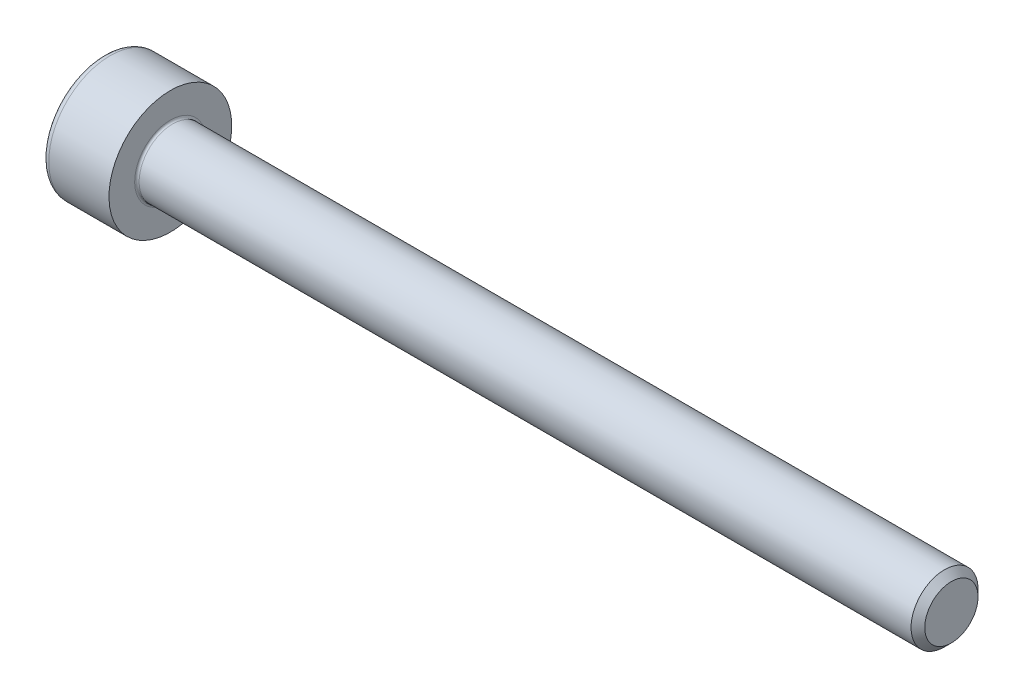
ISO-10303-21;
HEADER;
FILE_DESCRIPTION(('STEP AP214'),'2;1');
FILE_NAME('part.step','',(''),(''),'','','');
FILE_SCHEMA(('AUTOMOTIVE_DESIGN { 1 0 10303 214 1 1 1 1 }'));
ENDSEC;
DATA;
#1=APPLICATION_CONTEXT('core data for automotive mechanical design processes');
#2=APPLICATION_PROTOCOL_DEFINITION('international standard','automotive_design',2000,#1);
#3=PRODUCT_CONTEXT('',#1,'mechanical');
#4=PRODUCT('Part','Part','',(#3));
#5=PRODUCT_RELATED_PRODUCT_CATEGORY('part','',(#4));
#6=PRODUCT_DEFINITION_FORMATION('','',#4);
#7=PRODUCT_DEFINITION_CONTEXT('part definition',#1,'design');
#8=PRODUCT_DEFINITION('design','',#6,#7);
#9=PRODUCT_DEFINITION_SHAPE('','',#8);
#10=(LENGTH_UNIT() NAMED_UNIT(*) SI_UNIT(.MILLI.,.METRE.));
#11=(NAMED_UNIT(*) PLANE_ANGLE_UNIT() SI_UNIT($,.RADIAN.));
#12=(NAMED_UNIT(*) SI_UNIT($,.STERADIAN.) SOLID_ANGLE_UNIT());
#13=UNCERTAINTY_MEASURE_WITH_UNIT(LENGTH_MEASURE(1.E-05),#10,'distance_accuracy_value','');
#14=(GEOMETRIC_REPRESENTATION_CONTEXT(3) GLOBAL_UNCERTAINTY_ASSIGNED_CONTEXT((#13)) GLOBAL_UNIT_ASSIGNED_CONTEXT((#10,
#11,#12)) REPRESENTATION_CONTEXT('',''));
#15=CARTESIAN_POINT('',(0.,0.,0.));
#16=DIRECTION('',(0.,0.,1.));
#17=DIRECTION('',(1.,0.,0.));
#18=AXIS2_PLACEMENT_3D('',#15,#16,#17);
#19=CARTESIAN_POINT('',(0.100000000000002,0.,0.));
#20=DIRECTION('',(1.,0.,0.));
#21=DIRECTION('',(0.,1.,0.));
#22=AXIS2_PLACEMENT_3D('',#19,#20,#21);
#23=TOROIDAL_SURFACE('',#22,1.6,0.1);
#24=CARTESIAN_POINT('',(0.,0.,0.));
#25=DIRECTION('',(1.,0.,0.));
#26=DIRECTION('',(0.,1.,0.));
#27=AXIS2_PLACEMENT_3D('',#24,#25,#26);
#28=CIRCLE('',#27,1.6);
#29=CARTESIAN_POINT('',(0.,1.6,0.));
#30=VERTEX_POINT('',#29);
#31=EDGE_CURVE('E10',#30,#30,#28,.T.);
#32=ORIENTED_EDGE('',*,*,#31,.T.);
#33=EDGE_LOOP('',(#32));
#34=FACE_BOUND('',#33,.T.);
#35=CARTESIAN_POINT('',(0.100000000000002,0.,0.));
#36=DIRECTION('',(-1.,0.,0.));
#37=DIRECTION('',(0.,1.,0.));
#38=AXIS2_PLACEMENT_3D('',#35,#36,#37);
#39=CIRCLE('',#38,1.5);
#40=CARTESIAN_POINT('',(0.100000000000002,1.5,0.));
#41=VERTEX_POINT('',#40);
#42=EDGE_CURVE('E27',#41,#41,#39,.T.);
#43=ORIENTED_EDGE('',*,*,#42,.T.);
#44=EDGE_LOOP('',(#43));
#45=FACE_BOUND('',#44,.T.);
#46=ADVANCED_FACE('F16',(#34,#45),#23,.F.);
#47=CARTESIAN_POINT('',(26.,0.,0.));
#48=DIRECTION('',(1.,0.,0.));
#49=DIRECTION('',(0.,1.,0.));
#50=AXIS2_PLACEMENT_3D('',#47,#48,#49);
#51=CYLINDRICAL_SURFACE('',#50,1.5);
#52=CARTESIAN_POINT('',(34.693275,0.,0.));
#53=DIRECTION('',(1.,0.,0.));
#54=DIRECTION('',(0.,1.,0.));
#55=AXIS2_PLACEMENT_3D('',#52,#53,#54);
#56=CIRCLE('',#55,1.5);
#57=CARTESIAN_POINT('',(34.693275,1.5,0.));
#58=VERTEX_POINT('',#57);
#59=EDGE_CURVE('E161',#58,#58,#56,.T.);
#60=ORIENTED_EDGE('',*,*,#59,.F.);
#61=EDGE_LOOP('',(#60));
#62=FACE_BOUND('',#61,.T.);
#63=ORIENTED_EDGE('',*,*,#42,.F.);
#64=EDGE_LOOP('',(#63));
#65=FACE_BOUND('',#64,.T.);
#66=ADVANCED_FACE('F171',(#62,#65),#51,.T.);
#67=CARTESIAN_POINT('',(0.,2.125,0.));
#68=DIRECTION('',(1.,0.,0.));
#69=DIRECTION('',(0.,1.,0.));
#70=AXIS2_PLACEMENT_3D('',#67,#68,#69);
#71=PLANE('',#70);
#72=CARTESIAN_POINT('',(0.,0.,0.));
#73=DIRECTION('',(1.,0.,0.));
#74=DIRECTION('',(0.,1.,0.));
#75=AXIS2_PLACEMENT_3D('',#72,#73,#74);
#76=CIRCLE('',#75,2.75);
#77=CARTESIAN_POINT('',(0.,2.75,0.));
#78=VERTEX_POINT('',#77);
#79=EDGE_CURVE('E162',#78,#78,#76,.T.);
#80=ORIENTED_EDGE('',*,*,#79,.T.);
#81=EDGE_LOOP('',(#80));
#82=FACE_BOUND('',#81,.T.);
#83=ORIENTED_EDGE('',*,*,#31,.F.);
#84=EDGE_LOOP('',(#83));
#85=FACE_BOUND('',#84,.T.);
#86=ADVANCED_FACE('F173',(#82,#85),#71,.T.);
#87=CARTESIAN_POINT('',(34.8466375,0.,0.));
#88=DIRECTION('',(-1.,0.,0.));
#89=DIRECTION('',(0.,1.,0.));
#90=AXIS2_PLACEMENT_3D('',#87,#88,#89);
#91=CONICAL_SURFACE('',#90,1.3466375,0.785398163397445);
#92=ORIENTED_EDGE('',*,*,#59,.T.);
#93=EDGE_LOOP('',(#92));
#94=FACE_BOUND('',#93,.T.);
#95=CARTESIAN_POINT('',(35.,0.,0.));
#96=DIRECTION('',(-1.,0.,0.));
#97=DIRECTION('',(0.,1.,0.));
#98=AXIS2_PLACEMENT_3D('',#95,#96,#97);
#99=CIRCLE('',#98,1.193275);
#100=CARTESIAN_POINT('',(35.,1.193275,0.));
#101=VERTEX_POINT('',#100);
#102=EDGE_CURVE('E158',#101,#101,#99,.T.);
#103=ORIENTED_EDGE('',*,*,#102,.T.);
#104=EDGE_LOOP('',(#103));
#105=FACE_BOUND('',#104,.T.);
#106=ADVANCED_FACE('F181',(#94,#105),#91,.T.);
#107=CARTESIAN_POINT('',(35.,0.750000000000001,0.));
#108=DIRECTION('',(1.,0.,0.));
#109=DIRECTION('',(0.,1.,0.));
#110=AXIS2_PLACEMENT_3D('',#107,#108,#109);
#111=PLANE('',#110);
#112=ORIENTED_EDGE('',*,*,#102,.F.);
#113=EDGE_LOOP('',(#112));
#114=FACE_BOUND('',#113,.T.);
#115=ADVANCED_FACE('F196',(#114),#111,.T.);
#116=CARTESIAN_POINT('',(-2.69999999999999,0.,0.));
#117=DIRECTION('',(1.,0.,0.));
#118=DIRECTION('',(0.,1.,0.));
#119=AXIS2_PLACEMENT_3D('',#116,#117,#118);
#120=TOROIDAL_SURFACE('',#119,2.45,0.3);
#121=CARTESIAN_POINT('',(-2.99999999999999,0.,0.));
#122=DIRECTION('',(1.,0.,0.));
#123=DIRECTION('',(0.,1.,0.));
#124=AXIS2_PLACEMENT_3D('',#121,#122,#123);
#125=CIRCLE('',#124,2.45);
#126=CARTESIAN_POINT('',(-2.99999999999999,2.45,0.));
#127=VERTEX_POINT('',#126);
#128=EDGE_CURVE('E155',#127,#127,#125,.T.);
#129=ORIENTED_EDGE('',*,*,#128,.T.);
#130=EDGE_LOOP('',(#129));
#131=FACE_BOUND('',#130,.T.);
#132=CARTESIAN_POINT('',(-2.69999999999999,0.,0.));
#133=DIRECTION('',(-1.,0.,0.));
#134=DIRECTION('',(0.,1.,0.));
#135=AXIS2_PLACEMENT_3D('',#132,#133,#134);
#136=CIRCLE('',#135,2.75);
#137=CARTESIAN_POINT('',(-2.69999999999999,2.75,0.));
#138=VERTEX_POINT('',#137);
#139=EDGE_CURVE('E152',#138,#138,#136,.T.);
#140=ORIENTED_EDGE('',*,*,#139,.T.);
#141=EDGE_LOOP('',(#140));
#142=FACE_BOUND('',#141,.T.);
#143=ADVANCED_FACE('F201',(#131,#142),#120,.T.);
#144=CARTESIAN_POINT('',(-2.99999999999999,2.09668783648703,0.));
#145=DIRECTION('',(-1.,0.,0.));
#146=DIRECTION('',(0.,-1.,0.));
#147=AXIS2_PLACEMENT_3D('',#144,#145,#146);
#148=PLANE('',#147);
#149=DIRECTION('',(0.,0.,1.));
#150=VECTOR('',#149,1.);
#151=CARTESIAN_POINT('',(-2.99999999999999,1.25,0.360843918243515));
#152=LINE('',#151,#150);
#153=CARTESIAN_POINT('',(-2.99999999999999,1.25,-0.721687836487033));
#154=VERTEX_POINT('',#153);
#155=CARTESIAN_POINT('',(-2.99999999999999,1.25,0.72168783648703));
#156=VERTEX_POINT('',#155);
#157=EDGE_CURVE('E150',#154,#156,#152,.T.);
#158=ORIENTED_EDGE('',*,*,#157,.T.);
#159=DIRECTION('',(0.,-0.866025403784438,0.500000000000001));
#160=VECTOR('',#159,1.);
#161=CARTESIAN_POINT('',(-2.99999999999999,0.3125,1.26295371385231));
#162=LINE('',#161,#160);
#163=CARTESIAN_POINT('',(-2.99999999999999,0.,1.44337567297406));
#164=VERTEX_POINT('',#163);
#165=EDGE_CURVE('E39',#156,#164,#162,.T.);
#166=ORIENTED_EDGE('',*,*,#165,.T.);
#167=DIRECTION('',(0.,-0.866025403784439,-0.5));
#168=VECTOR('',#167,1.);
#169=CARTESIAN_POINT('',(-2.99999999999999,-0.9375,0.902109795608791));
#170=LINE('',#169,#168);
#171=CARTESIAN_POINT('',(-2.99999999999999,-1.25,0.721687836487033));
#172=VERTEX_POINT('',#171);
#173=EDGE_CURVE('E95',#164,#172,#170,.T.);
#174=ORIENTED_EDGE('',*,*,#173,.T.);
#175=DIRECTION('',(0.,0.,-1.));
#176=VECTOR('',#175,1.);
#177=CARTESIAN_POINT('',(-2.99999999999999,-1.25,-0.360843918243516));
#178=LINE('',#177,#176);
#179=CARTESIAN_POINT('',(-2.99999999999999,-1.25,-0.721687836487032));
#180=VERTEX_POINT('',#179);
#181=EDGE_CURVE('E88',#172,#180,#178,.T.);
#182=ORIENTED_EDGE('',*,*,#181,.T.);
#183=DIRECTION('',(0.,0.866025403784439,-0.5));
#184=VECTOR('',#183,1.);
#185=CARTESIAN_POINT('',(-2.99999999999999,-0.3125,-1.26295371385231));
#186=LINE('',#185,#184);
#187=CARTESIAN_POINT('',(-2.99999999999999,0.,-1.44337567297406));
#188=VERTEX_POINT('',#187);
#189=EDGE_CURVE('E144',#180,#188,#186,.T.);
#190=ORIENTED_EDGE('',*,*,#189,.T.);
#191=DIRECTION('',(0.,0.866025403784439,0.5));
#192=VECTOR('',#191,1.);
#193=CARTESIAN_POINT('',(-2.99999999999999,0.9375,-0.902109795608791));
#194=LINE('',#193,#192);
#195=EDGE_CURVE('E135',#188,#154,#194,.T.);
#196=ORIENTED_EDGE('',*,*,#195,.T.);
#197=EDGE_LOOP('',(#158,#166,#174,#182,#190,#196));
#198=FACE_BOUND('',#197,.T.);
#199=ORIENTED_EDGE('',*,*,#128,.F.);
#200=EDGE_LOOP('',(#199));
#201=FACE_BOUND('',#200,.T.);
#202=ADVANCED_FACE('F193',(#198,#201),#148,.T.);
#203=CARTESIAN_POINT('',(-1.49999999999999,0.,0.));
#204=DIRECTION('',(1.,0.,0.));
#205=DIRECTION('',(0.,1.,0.));
#206=AXIS2_PLACEMENT_3D('',#203,#204,#205);
#207=CYLINDRICAL_SURFACE('',#206,2.75);
#208=ORIENTED_EDGE('',*,*,#79,.F.);
#209=EDGE_LOOP('',(#208));
#210=FACE_BOUND('',#209,.T.);
#211=ORIENTED_EDGE('',*,*,#139,.F.);
#212=EDGE_LOOP('',(#211));
#213=FACE_BOUND('',#212,.T.);
#214=ADVANCED_FACE('F190',(#210,#213),#207,.T.);
#215=CARTESIAN_POINT('',(-2.99999999999999,0.,-1.44337567297406));
#216=DIRECTION('',(0.,-0.5,-0.866025403784439));
#217=DIRECTION('',(0.,0.866025403784439,-0.5));
#218=AXIS2_PLACEMENT_3D('',#215,#216,#217);
#219=PLANE('',#218);
#220=CARTESIAN_POINT('',(-1.49999999999999,0.,-1.44337567297407));
#221=CARTESIAN_POINT('',(-1.29166666666665,-0.625000000000001,-1.08253175473055));
#222=CARTESIAN_POINT('',(-1.49999999999999,-1.25000000000001,-0.721687836487024));
#223=(BOUNDED_CURVE() B_SPLINE_CURVE(2,(#220,#221,#222),.UNSPECIFIED.,.F.,
.F.) B_SPLINE_CURVE_WITH_KNOTS((3,3),(0.,0.146054517259743),
.UNSPECIFIED.) CURVE() GEOMETRIC_REPRESENTATION_ITEM() RATIONAL_B_SPLINE_CURVE((1.,
1.15470053837926,1.)) REPRESENTATION_ITEM(''));
#224=CARTESIAN_POINT('',(-1.49999999999999,0.,-1.44337567297406));
#225=VERTEX_POINT('',#224);
#226=CARTESIAN_POINT('',(-1.49999999999999,-1.25,-0.721687836487032));
#227=VERTEX_POINT('',#226);
#228=EDGE_CURVE('E79',#225,#227,#223,.T.);
#229=ORIENTED_EDGE('',*,*,#228,.F.);
#230=DIRECTION('',(-1.,0.,0.));
#231=VECTOR('',#230,1.);
#232=CARTESIAN_POINT('',(-2.24999999999999,0.,-1.44337567297406));
#233=LINE('',#232,#231);
#234=EDGE_CURVE('E125',#225,#188,#233,.T.);
#235=ORIENTED_EDGE('',*,*,#234,.T.);
#236=ORIENTED_EDGE('',*,*,#189,.F.);
#237=DIRECTION('',(-1.,0.,0.));
#238=VECTOR('',#237,1.);
#239=CARTESIAN_POINT('',(-2.24999999999999,-1.25,-0.721687836487033));
#240=LINE('',#239,#238);
#241=EDGE_CURVE('E91',#227,#180,#240,.T.);
#242=ORIENTED_EDGE('',*,*,#241,.F.);
#243=EDGE_LOOP('',(#229,#235,#236,#242));
#244=FACE_BOUND('',#243,.T.);
#245=ADVANCED_FACE('F192',(#244),#219,.F.);
#246=CARTESIAN_POINT('',(-2.99999999999999,1.25,-0.721687836487033));
#247=DIRECTION('',(0.,0.5,-0.866025403784439));
#248=DIRECTION('',(0.,0.866025403784439,0.5));
#249=AXIS2_PLACEMENT_3D('',#246,#247,#248);
#250=PLANE('',#249);
#251=CARTESIAN_POINT('',(-1.49999999999999,1.25000000000001,-0.721687836487025));
#252=CARTESIAN_POINT('',(-1.29166666666665,0.625,-1.08253175473055));
#253=CARTESIAN_POINT('',(-1.49999999999999,0.,-1.44337567297407));
#254=(BOUNDED_CURVE() B_SPLINE_CURVE(2,(#251,#252,#253),.UNSPECIFIED.,.F.,
.F.) B_SPLINE_CURVE_WITH_KNOTS((3,3),(0.,0.146054517259743),
.UNSPECIFIED.) CURVE() GEOMETRIC_REPRESENTATION_ITEM() RATIONAL_B_SPLINE_CURVE((1.,
1.15470053837926,1.)) REPRESENTATION_ITEM(''));
#255=CARTESIAN_POINT('',(-1.49999999999999,1.25,-0.721687836487035));
#256=VERTEX_POINT('',#255);
#257=EDGE_CURVE('E119',#256,#225,#254,.T.);
#258=ORIENTED_EDGE('',*,*,#257,.F.);
#259=DIRECTION('',(-1.,0.,0.));
#260=VECTOR('',#259,1.);
#261=CARTESIAN_POINT('',(-2.24999999999999,1.25,-0.721687836487034));
#262=LINE('',#261,#260);
#263=EDGE_CURVE('E114',#256,#154,#262,.T.);
#264=ORIENTED_EDGE('',*,*,#263,.T.);
#265=ORIENTED_EDGE('',*,*,#195,.F.);
#266=ORIENTED_EDGE('',*,*,#234,.F.);
#267=EDGE_LOOP('',(#258,#264,#265,#266));
#268=FACE_BOUND('',#267,.T.);
#269=ADVANCED_FACE('F217',(#268),#250,.F.);
#270=CARTESIAN_POINT('',(-2.99999999999999,1.25,0.72168783648703));
#271=DIRECTION('',(0.,1.,0.));
#272=DIRECTION('',(0.,0.,1.));
#273=AXIS2_PLACEMENT_3D('',#270,#271,#272);
#274=PLANE('',#273);
#275=CARTESIAN_POINT('',(-1.49999999999999,1.25,0.721687836487046));
#276=CARTESIAN_POINT('',(-1.29166666666665,1.25,0.));
#277=CARTESIAN_POINT('',(-1.49999999999999,1.25,-0.721687836487049));
#278=(BOUNDED_CURVE() B_SPLINE_CURVE(2,(#275,#276,#277),.UNSPECIFIED.,.F.,
.F.) B_SPLINE_CURVE_WITH_KNOTS((3,3),(0.,0.146054517259743),
.UNSPECIFIED.) CURVE() GEOMETRIC_REPRESENTATION_ITEM() RATIONAL_B_SPLINE_CURVE((1.,
1.15470053837925,1.)) REPRESENTATION_ITEM(''));
#279=CARTESIAN_POINT('',(-1.49999999999999,1.25,0.72168783648703));
#280=VERTEX_POINT('',#279);
#281=EDGE_CURVE('E98',#280,#256,#278,.T.);
#282=ORIENTED_EDGE('',*,*,#281,.F.);
#283=DIRECTION('',(-1.,0.,0.));
#284=VECTOR('',#283,1.);
#285=CARTESIAN_POINT('',(-2.24999999999999,1.25,0.72168783648703));
#286=LINE('',#285,#284);
#287=EDGE_CURVE('E108',#280,#156,#286,.T.);
#288=ORIENTED_EDGE('',*,*,#287,.T.);
#289=ORIENTED_EDGE('',*,*,#157,.F.);
#290=ORIENTED_EDGE('',*,*,#263,.F.);
#291=EDGE_LOOP('',(#282,#288,#289,#290));
#292=FACE_BOUND('',#291,.T.);
#293=ADVANCED_FACE('F221',(#292),#274,.F.);
#294=CARTESIAN_POINT('',(-2.99999999999999,0.,1.44337567297406));
#295=DIRECTION('',(0.,0.500000000000001,0.866025403784438));
#296=DIRECTION('',(0.,-0.866025403784438,0.500000000000001));
#297=AXIS2_PLACEMENT_3D('',#294,#295,#296);
#298=PLANE('',#297);
#299=CARTESIAN_POINT('',(-1.49999999999999,0.,1.44337567297407));
#300=CARTESIAN_POINT('',(-1.29166666666665,0.625,1.08253175473055));
#301=CARTESIAN_POINT('',(-1.49999999999999,1.25000000000002,0.721687836487022));
#302=(BOUNDED_CURVE() B_SPLINE_CURVE(2,(#299,#300,#301),.UNSPECIFIED.,.F.,
.F.) B_SPLINE_CURVE_WITH_KNOTS((3,3),(0.,0.146054517259743),
.UNSPECIFIED.) CURVE() GEOMETRIC_REPRESENTATION_ITEM() RATIONAL_B_SPLINE_CURVE((1.,
1.15470053837926,1.)) REPRESENTATION_ITEM(''));
#303=CARTESIAN_POINT('',(-1.49999999999999,0.,1.44337567297406));
#304=VERTEX_POINT('',#303);
#305=EDGE_CURVE('E96',#304,#280,#302,.T.);
#306=ORIENTED_EDGE('',*,*,#305,.F.);
#307=DIRECTION('',(1.,0.,0.));
#308=VECTOR('',#307,1.);
#309=CARTESIAN_POINT('',(-2.24999999999999,0.,1.44337567297406));
#310=LINE('',#309,#308);
#311=EDGE_CURVE('E92',#164,#304,#310,.T.);
#312=ORIENTED_EDGE('',*,*,#311,.F.);
#313=ORIENTED_EDGE('',*,*,#165,.F.);
#314=ORIENTED_EDGE('',*,*,#287,.F.);
#315=EDGE_LOOP('',(#306,#312,#313,#314));
#316=FACE_BOUND('',#315,.T.);
#317=ADVANCED_FACE('F225',(#316),#298,.F.);
#318=CARTESIAN_POINT('',(-2.99999999999999,-1.25,-0.721687836487032));
#319=DIRECTION('',(0.,-1.,0.));
#320=DIRECTION('',(1.,0.,0.));
#321=AXIS2_PLACEMENT_3D('',#318,#319,#320);
#322=PLANE('',#321);
#323=CARTESIAN_POINT('',(-1.49999999999999,-1.25,-0.721687836487048));
#324=CARTESIAN_POINT('',(-1.29166666666665,-1.25,0.));
#325=CARTESIAN_POINT('',(-1.49999999999999,-1.25,0.721687836487048));
#326=(BOUNDED_CURVE() B_SPLINE_CURVE(2,(#323,#324,#325),.UNSPECIFIED.,.F.,
.F.) B_SPLINE_CURVE_WITH_KNOTS((3,3),(0.,0.146054517259743),
.UNSPECIFIED.) CURVE() GEOMETRIC_REPRESENTATION_ITEM() RATIONAL_B_SPLINE_CURVE((1.,
1.15470053837926,1.)) REPRESENTATION_ITEM(''));
#327=CARTESIAN_POINT('',(-1.49999999999999,-1.25,0.721687836487032));
#328=VERTEX_POINT('',#327);
#329=EDGE_CURVE('E74',#227,#328,#326,.T.);
#330=ORIENTED_EDGE('',*,*,#329,.F.);
#331=ORIENTED_EDGE('',*,*,#241,.T.);
#332=ORIENTED_EDGE('',*,*,#181,.F.);
#333=DIRECTION('',(-1.,0.,0.));
#334=VECTOR('',#333,1.);
#335=CARTESIAN_POINT('',(-2.24999999999999,-1.25,0.721687836487032));
#336=LINE('',#335,#334);
#337=EDGE_CURVE('E85',#328,#172,#336,.T.);
#338=ORIENTED_EDGE('',*,*,#337,.F.);
#339=EDGE_LOOP('',(#330,#331,#332,#338));
#340=FACE_BOUND('',#339,.T.);
#341=ADVANCED_FACE('F86',(#340),#322,.F.);
#342=CARTESIAN_POINT('',(-2.99999999999999,-1.25,0.721687836487033));
#343=DIRECTION('',(0.,-0.5,0.866025403784439));
#344=DIRECTION('',(0.,-0.866025403784439,-0.5));
#345=AXIS2_PLACEMENT_3D('',#342,#343,#344);
#346=PLANE('',#345);
#347=CARTESIAN_POINT('',(-1.49999999999999,-1.25000000000001,0.721687836487025));
#348=CARTESIAN_POINT('',(-1.29166666666665,-0.625,1.08253175473055));
#349=CARTESIAN_POINT('',(-1.49999999999999,0.,1.44337567297407));
#350=(BOUNDED_CURVE() B_SPLINE_CURVE(2,(#347,#348,#349),.UNSPECIFIED.,.F.,
.F.) B_SPLINE_CURVE_WITH_KNOTS((3,3),(0.,0.146054517259743),
.UNSPECIFIED.) CURVE() GEOMETRIC_REPRESENTATION_ITEM() RATIONAL_B_SPLINE_CURVE((1.,
1.15470053837926,1.)) REPRESENTATION_ITEM(''));
#351=EDGE_CURVE('E20',#328,#304,#350,.T.);
#352=ORIENTED_EDGE('',*,*,#351,.F.);
#353=ORIENTED_EDGE('',*,*,#337,.T.);
#354=ORIENTED_EDGE('',*,*,#173,.F.);
#355=ORIENTED_EDGE('',*,*,#311,.T.);
#356=EDGE_LOOP('',(#352,#353,#354,#355));
#357=FACE_BOUND('',#356,.T.);
#358=ADVANCED_FACE('F94',(#357),#346,.F.);
#359=CARTESIAN_POINT('',(-1.08333333333333,0.,0.));
#360=DIRECTION('',(-1.,0.,0.));
#361=DIRECTION('',(0.,1.,0.));
#362=AXIS2_PLACEMENT_3D('',#359,#360,#361);
#363=CONICAL_SURFACE('',#362,0.721687836487032,1.0471975511966);
#364=CARTESIAN_POINT('',(-0.66666666666666,0.,0.));
#365=VERTEX_POINT('',#364);
#366=VERTEX_LOOP('',#365);
#367=FACE_BOUND('',#366,.T.);
#368=ORIENTED_EDGE('',*,*,#305,.T.);
#369=ORIENTED_EDGE('',*,*,#281,.T.);
#370=ORIENTED_EDGE('',*,*,#257,.T.);
#371=ORIENTED_EDGE('',*,*,#228,.T.);
#372=ORIENTED_EDGE('',*,*,#329,.T.);
#373=ORIENTED_EDGE('',*,*,#351,.T.);
#374=EDGE_LOOP('',(#368,#369,#370,#371,#372,#373));
#375=FACE_BOUND('',#374,.T.);
#376=ADVANCED_FACE('F18',(#367,#375),#363,.F.);
#377=CLOSED_SHELL('',(#46,#66,#86,#106,#115,#143,#202,#214,#245,#269,#293,#317,#341,#358,#376));
#378=MANIFOLD_SOLID_BREP('B1',#377);
#379=ADVANCED_BREP_SHAPE_REPRESENTATION('',(#18,#378),#14);
#380=SHAPE_DEFINITION_REPRESENTATION(#9,#379);
ENDSEC;
END-ISO-10303-21;
